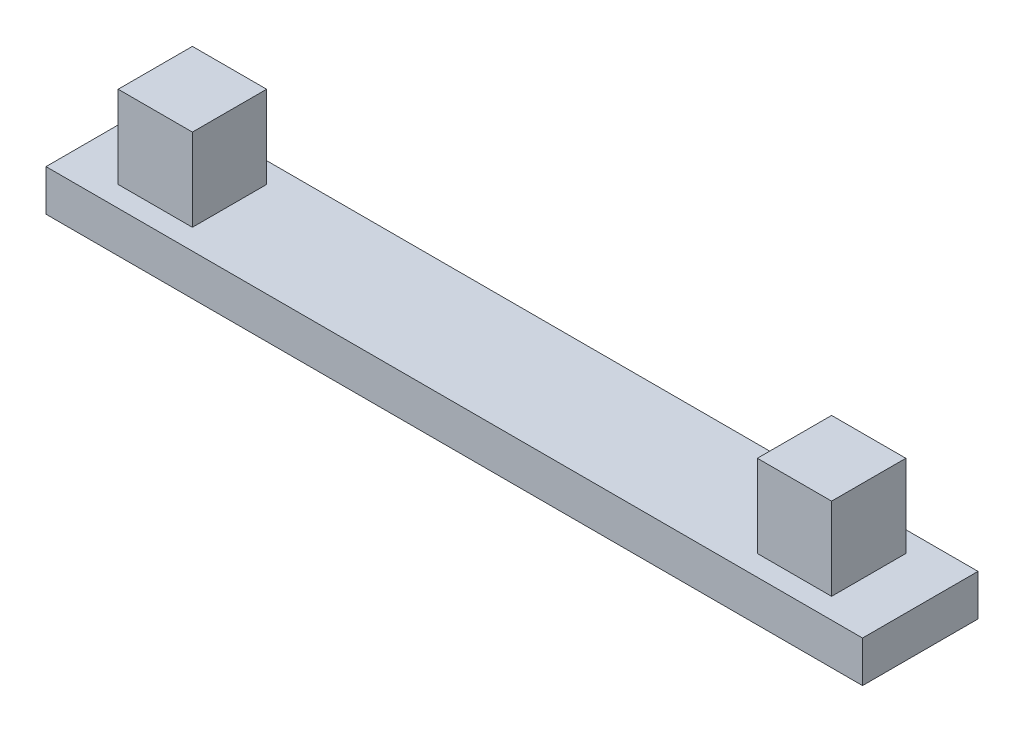
ISO-10303-21;
HEADER;
FILE_DESCRIPTION(('STEP AP214'),'2;1');
FILE_NAME('part.step','',(''),(''),'','','');
FILE_SCHEMA(('AUTOMOTIVE_DESIGN { 1 0 10303 214 1 1 1 1 }'));
ENDSEC;
DATA;
#1=APPLICATION_CONTEXT('core data for automotive mechanical design processes');
#2=APPLICATION_PROTOCOL_DEFINITION('international standard','automotive_design',2000,#1);
#3=PRODUCT_CONTEXT('',#1,'mechanical');
#4=PRODUCT('Part','Part','',(#3));
#5=PRODUCT_RELATED_PRODUCT_CATEGORY('part','',(#4));
#6=PRODUCT_DEFINITION_FORMATION('','',#4);
#7=PRODUCT_DEFINITION_CONTEXT('part definition',#1,'design');
#8=PRODUCT_DEFINITION('design','',#6,#7);
#9=PRODUCT_DEFINITION_SHAPE('','',#8);
#10=(LENGTH_UNIT() NAMED_UNIT(*) SI_UNIT(.MILLI.,.METRE.));
#11=(NAMED_UNIT(*) PLANE_ANGLE_UNIT() SI_UNIT($,.RADIAN.));
#12=(NAMED_UNIT(*) SI_UNIT($,.STERADIAN.) SOLID_ANGLE_UNIT());
#13=UNCERTAINTY_MEASURE_WITH_UNIT(LENGTH_MEASURE(1.E-05),#10,'distance_accuracy_value','');
#14=(GEOMETRIC_REPRESENTATION_CONTEXT(3) GLOBAL_UNCERTAINTY_ASSIGNED_CONTEXT((#13)) GLOBAL_UNIT_ASSIGNED_CONTEXT((#10,
#11,#12)) REPRESENTATION_CONTEXT('',''));
#15=CARTESIAN_POINT('',(0.,0.,0.));
#16=DIRECTION('',(0.,0.,1.));
#17=DIRECTION('',(1.,0.,0.));
#18=AXIS2_PLACEMENT_3D('',#15,#16,#17);
#19=CARTESIAN_POINT('',(0.,1.,0.));
#20=DIRECTION('',(0.,0.,-1.));
#21=DIRECTION('',(-1.,0.,0.));
#22=AXIS2_PLACEMENT_3D('',#19,#20,#21);
#23=PLANE('',#22);
#24=DIRECTION('',(1.,0.,0.));
#25=VECTOR('',#24,1.);
#26=CARTESIAN_POINT('',(0.,0.,0.));
#27=LINE('',#26,#25);
#28=CARTESIAN_POINT('',(0.,0.,0.));
#29=VERTEX_POINT('',#28);
#30=CARTESIAN_POINT('',(19.8,0.,0.));
#31=VERTEX_POINT('',#30);
#32=EDGE_CURVE('E136',#29,#31,#27,.T.);
#33=ORIENTED_EDGE('',*,*,#32,.T.);
#34=DIRECTION('',(0.,-1.,0.));
#35=VECTOR('',#34,1.);
#36=CARTESIAN_POINT('',(19.8,1.,0.));
#37=LINE('',#36,#35);
#38=CARTESIAN_POINT('',(19.8,1.,0.));
#39=VERTEX_POINT('',#38);
#40=EDGE_CURVE('E11',#39,#31,#37,.T.);
#41=ORIENTED_EDGE('',*,*,#40,.F.);
#42=DIRECTION('',(1.,0.,0.));
#43=VECTOR('',#42,1.);
#44=CARTESIAN_POINT('',(0.,1.,0.));
#45=LINE('',#44,#43);
#46=CARTESIAN_POINT('',(0.,1.,0.));
#47=VERTEX_POINT('',#46);
#48=EDGE_CURVE('E101',#47,#39,#45,.T.);
#49=ORIENTED_EDGE('',*,*,#48,.F.);
#50=DIRECTION('',(0.,-1.,0.));
#51=VECTOR('',#50,1.);
#52=CARTESIAN_POINT('',(0.,1.,0.));
#53=LINE('',#52,#51);
#54=EDGE_CURVE('E78',#47,#29,#53,.T.);
#55=ORIENTED_EDGE('',*,*,#54,.T.);
#56=EDGE_LOOP('',(#33,#41,#49,#55));
#57=FACE_BOUND('',#56,.T.);
#58=ADVANCED_FACE('F35',(#57),#23,.F.);
#59=CARTESIAN_POINT('',(19.8,1.,0.));
#60=DIRECTION('',(-1.,0.,0.));
#61=DIRECTION('',(0.,0.,1.));
#62=AXIS2_PLACEMENT_3D('',#59,#60,#61);
#63=PLANE('',#62);
#64=DIRECTION('',(0.,0.,-1.));
#65=VECTOR('',#64,1.);
#66=CARTESIAN_POINT('',(19.8,0.,0.));
#67=LINE('',#66,#65);
#68=CARTESIAN_POINT('',(19.8,0.,-2.8));
#69=VERTEX_POINT('',#68);
#70=EDGE_CURVE('E138',#31,#69,#67,.T.);
#71=ORIENTED_EDGE('',*,*,#70,.T.);
#72=DIRECTION('',(0.,-1.,0.));
#73=VECTOR('',#72,1.);
#74=CARTESIAN_POINT('',(19.8,1.,-2.8));
#75=LINE('',#74,#73);
#76=CARTESIAN_POINT('',(19.8,1.,-2.8));
#77=VERTEX_POINT('',#76);
#78=EDGE_CURVE('E43',#77,#69,#75,.T.);
#79=ORIENTED_EDGE('',*,*,#78,.F.);
#80=DIRECTION('',(0.,0.,-1.));
#81=VECTOR('',#80,1.);
#82=CARTESIAN_POINT('',(19.8,1.,0.));
#83=LINE('',#82,#81);
#84=EDGE_CURVE('E86',#39,#77,#83,.T.);
#85=ORIENTED_EDGE('',*,*,#84,.F.);
#86=ORIENTED_EDGE('',*,*,#40,.T.);
#87=EDGE_LOOP('',(#71,#79,#85,#86));
#88=FACE_BOUND('',#87,.T.);
#89=ADVANCED_FACE('F148',(#88),#63,.F.);
#90=CARTESIAN_POINT('',(0.,1.,-2.8));
#91=DIRECTION('',(0.,0.,-1.));
#92=DIRECTION('',(-1.,0.,0.));
#93=AXIS2_PLACEMENT_3D('',#90,#91,#92);
#94=PLANE('',#93);
#95=DIRECTION('',(1.,0.,0.));
#96=VECTOR('',#95,1.);
#97=CARTESIAN_POINT('',(0.,0.,-2.8));
#98=LINE('',#97,#96);
#99=CARTESIAN_POINT('',(0.,0.,-2.8));
#100=VERTEX_POINT('',#99);
#101=EDGE_CURVE('E142',#100,#69,#98,.T.);
#102=ORIENTED_EDGE('',*,*,#101,.F.);
#103=DIRECTION('',(0.,-1.,0.));
#104=VECTOR('',#103,1.);
#105=CARTESIAN_POINT('',(0.,1.,-2.8));
#106=LINE('',#105,#104);
#107=CARTESIAN_POINT('',(0.,1.,-2.8));
#108=VERTEX_POINT('',#107);
#109=EDGE_CURVE('E70',#108,#100,#106,.T.);
#110=ORIENTED_EDGE('',*,*,#109,.F.);
#111=DIRECTION('',(1.,0.,0.));
#112=VECTOR('',#111,1.);
#113=CARTESIAN_POINT('',(0.,1.,-2.8));
#114=LINE('',#113,#112);
#115=EDGE_CURVE('E108',#108,#77,#114,.T.);
#116=ORIENTED_EDGE('',*,*,#115,.T.);
#117=ORIENTED_EDGE('',*,*,#78,.T.);
#118=EDGE_LOOP('',(#102,#110,#116,#117));
#119=FACE_BOUND('',#118,.T.);
#120=ADVANCED_FACE('F147',(#119),#94,.T.);
#121=CARTESIAN_POINT('',(0.,1.,0.));
#122=DIRECTION('',(-1.,0.,0.));
#123=DIRECTION('',(0.,0.,1.));
#124=AXIS2_PLACEMENT_3D('',#121,#122,#123);
#125=PLANE('',#124);
#126=DIRECTION('',(0.,0.,-1.));
#127=VECTOR('',#126,1.);
#128=CARTESIAN_POINT('',(0.,0.,0.));
#129=LINE('',#128,#127);
#130=EDGE_CURVE('E97',#29,#100,#129,.T.);
#131=ORIENTED_EDGE('',*,*,#130,.F.);
#132=ORIENTED_EDGE('',*,*,#54,.F.);
#133=DIRECTION('',(0.,0.,-1.));
#134=VECTOR('',#133,1.);
#135=CARTESIAN_POINT('',(0.,1.,0.));
#136=LINE('',#135,#134);
#137=EDGE_CURVE('E95',#47,#108,#136,.T.);
#138=ORIENTED_EDGE('',*,*,#137,.T.);
#139=ORIENTED_EDGE('',*,*,#109,.T.);
#140=EDGE_LOOP('',(#131,#132,#138,#139));
#141=FACE_BOUND('',#140,.T.);
#142=ADVANCED_FACE('F93',(#141),#125,.T.);
#143=CARTESIAN_POINT('',(0.,1.,0.));
#144=DIRECTION('',(0.,1.,0.));
#145=DIRECTION('',(0.,0.,1.));
#146=AXIS2_PLACEMENT_3D('',#143,#144,#145);
#147=PLANE('',#146);
#148=ORIENTED_EDGE('',*,*,#48,.T.);
#149=ORIENTED_EDGE('',*,*,#84,.T.);
#150=ORIENTED_EDGE('',*,*,#115,.F.);
#151=ORIENTED_EDGE('',*,*,#137,.F.);
#152=EDGE_LOOP('',(#148,#149,#150,#151));
#153=FACE_BOUND('',#152,.T.);
#154=DIRECTION('',(1.,0.,0.));
#155=VECTOR('',#154,1.);
#156=CARTESIAN_POINT('',(0.,1.,-2.3));
#157=LINE('',#156,#155);
#158=CARTESIAN_POINT('',(1.25,1.,-2.3));
#159=VERTEX_POINT('',#158);
#160=CARTESIAN_POINT('',(3.05,1.,-2.3));
#161=VERTEX_POINT('',#160);
#162=EDGE_CURVE('E109',#159,#161,#157,.T.);
#163=ORIENTED_EDGE('',*,*,#162,.T.);
#164=DIRECTION('',(0.,0.,1.));
#165=VECTOR('',#164,1.);
#166=CARTESIAN_POINT('',(3.05,1.,0.));
#167=LINE('',#166,#165);
#168=CARTESIAN_POINT('',(3.05,1.,-0.5));
#169=VERTEX_POINT('',#168);
#170=EDGE_CURVE('E112',#161,#169,#167,.T.);
#171=ORIENTED_EDGE('',*,*,#170,.T.);
#172=DIRECTION('',(1.,0.,0.));
#173=VECTOR('',#172,1.);
#174=CARTESIAN_POINT('',(0.,1.,-0.5));
#175=LINE('',#174,#173);
#176=CARTESIAN_POINT('',(1.25,1.,-0.5));
#177=VERTEX_POINT('',#176);
#178=EDGE_CURVE('E119',#177,#169,#175,.T.);
#179=ORIENTED_EDGE('',*,*,#178,.F.);
#180=DIRECTION('',(0.,0.,1.));
#181=VECTOR('',#180,1.);
#182=CARTESIAN_POINT('',(1.25,1.,0.));
#183=LINE('',#182,#181);
#184=EDGE_CURVE('E122',#159,#177,#183,.T.);
#185=ORIENTED_EDGE('',*,*,#184,.F.);
#186=EDGE_LOOP('',(#163,#171,#179,#185));
#187=FACE_BOUND('',#186,.T.);
#188=DIRECTION('',(1.,0.,0.));
#189=VECTOR('',#188,1.);
#190=CARTESIAN_POINT('',(0.,1.,-2.3));
#191=LINE('',#190,#189);
#192=CARTESIAN_POINT('',(16.75,1.,-2.3));
#193=VERTEX_POINT('',#192);
#194=CARTESIAN_POINT('',(18.55,1.,-2.3));
#195=VERTEX_POINT('',#194);
#196=EDGE_CURVE('E125',#193,#195,#191,.T.);
#197=ORIENTED_EDGE('',*,*,#196,.T.);
#198=DIRECTION('',(0.,0.,1.));
#199=VECTOR('',#198,1.);
#200=CARTESIAN_POINT('',(18.55,1.,0.));
#201=LINE('',#200,#199);
#202=CARTESIAN_POINT('',(18.55,1.,-0.499999999999999));
#203=VERTEX_POINT('',#202);
#204=EDGE_CURVE('E128',#195,#203,#201,.T.);
#205=ORIENTED_EDGE('',*,*,#204,.T.);
#206=DIRECTION('',(1.,0.,0.));
#207=VECTOR('',#206,1.);
#208=CARTESIAN_POINT('',(0.,1.,-0.499999999999999));
#209=LINE('',#208,#207);
#210=CARTESIAN_POINT('',(16.75,1.,-0.499999999999999));
#211=VERTEX_POINT('',#210);
#212=EDGE_CURVE('E131',#211,#203,#209,.T.);
#213=ORIENTED_EDGE('',*,*,#212,.F.);
#214=DIRECTION('',(0.,0.,1.));
#215=VECTOR('',#214,1.);
#216=CARTESIAN_POINT('',(16.75,1.,0.));
#217=LINE('',#216,#215);
#218=EDGE_CURVE('E98',#193,#211,#217,.T.);
#219=ORIENTED_EDGE('',*,*,#218,.F.);
#220=EDGE_LOOP('',(#197,#205,#213,#219));
#221=FACE_BOUND('',#220,.T.);
#222=ADVANCED_FACE('F105',(#153,#187,#221),#147,.T.);
#223=CARTESIAN_POINT('',(0.,0.,0.));
#224=DIRECTION('',(0.,1.,0.));
#225=DIRECTION('',(0.,0.,1.));
#226=AXIS2_PLACEMENT_3D('',#223,#224,#225);
#227=PLANE('',#226);
#228=ORIENTED_EDGE('',*,*,#32,.F.);
#229=ORIENTED_EDGE('',*,*,#130,.T.);
#230=ORIENTED_EDGE('',*,*,#101,.T.);
#231=ORIENTED_EDGE('',*,*,#70,.F.);
#232=EDGE_LOOP('',(#228,#229,#230,#231));
#233=FACE_BOUND('',#232,.T.);
#234=ADVANCED_FACE('F150',(#233),#227,.F.);
#235=CARTESIAN_POINT('',(1.25,3.,-2.3));
#236=DIRECTION('',(1.,0.,0.));
#237=DIRECTION('',(0.,0.,-1.));
#238=AXIS2_PLACEMENT_3D('',#235,#236,#237);
#239=PLANE('',#238);
#240=ORIENTED_EDGE('',*,*,#184,.T.);
#241=DIRECTION('',(0.,-1.,0.));
#242=VECTOR('',#241,1.);
#243=CARTESIAN_POINT('',(1.25,3.,-0.5));
#244=LINE('',#243,#242);
#245=CARTESIAN_POINT('',(1.25,3.,-0.5));
#246=VERTEX_POINT('',#245);
#247=EDGE_CURVE('E139',#246,#177,#244,.T.);
#248=ORIENTED_EDGE('',*,*,#247,.F.);
#249=DIRECTION('',(0.,0.,1.));
#250=VECTOR('',#249,1.);
#251=CARTESIAN_POINT('',(1.25,3.,-2.3));
#252=LINE('',#251,#250);
#253=CARTESIAN_POINT('',(1.25,3.,-2.3));
#254=VERTEX_POINT('',#253);
#255=EDGE_CURVE('E301',#254,#246,#252,.T.);
#256=ORIENTED_EDGE('',*,*,#255,.F.);
#257=DIRECTION('',(0.,-1.,0.));
#258=VECTOR('',#257,1.);
#259=CARTESIAN_POINT('',(1.25,3.,-2.3));
#260=LINE('',#259,#258);
#261=EDGE_CURVE('E332',#254,#159,#260,.T.);
#262=ORIENTED_EDGE('',*,*,#261,.T.);
#263=EDGE_LOOP('',(#240,#248,#256,#262));
#264=FACE_BOUND('',#263,.T.);
#265=ADVANCED_FACE('F152',(#264),#239,.F.);
#266=CARTESIAN_POINT('',(1.25,3.,-0.5));
#267=DIRECTION('',(0.,0.,-1.));
#268=DIRECTION('',(-1.,0.,0.));
#269=AXIS2_PLACEMENT_3D('',#266,#267,#268);
#270=PLANE('',#269);
#271=ORIENTED_EDGE('',*,*,#178,.T.);
#272=DIRECTION('',(0.,-1.,0.));
#273=VECTOR('',#272,1.);
#274=CARTESIAN_POINT('',(3.05,3.,-0.5));
#275=LINE('',#274,#273);
#276=CARTESIAN_POINT('',(3.05,3.,-0.5));
#277=VERTEX_POINT('',#276);
#278=EDGE_CURVE('E337',#277,#169,#275,.T.);
#279=ORIENTED_EDGE('',*,*,#278,.F.);
#280=DIRECTION('',(1.,0.,0.));
#281=VECTOR('',#280,1.);
#282=CARTESIAN_POINT('',(1.25,3.,-0.5));
#283=LINE('',#282,#281);
#284=EDGE_CURVE('E323',#246,#277,#283,.T.);
#285=ORIENTED_EDGE('',*,*,#284,.F.);
#286=ORIENTED_EDGE('',*,*,#247,.T.);
#287=EDGE_LOOP('',(#271,#279,#285,#286));
#288=FACE_BOUND('',#287,.T.);
#289=ADVANCED_FACE('F158',(#288),#270,.F.);
#290=CARTESIAN_POINT('',(3.05,3.,-2.3));
#291=DIRECTION('',(1.,0.,0.));
#292=DIRECTION('',(0.,0.,-1.));
#293=AXIS2_PLACEMENT_3D('',#290,#291,#292);
#294=PLANE('',#293);
#295=ORIENTED_EDGE('',*,*,#278,.T.);
#296=ORIENTED_EDGE('',*,*,#170,.F.);
#297=DIRECTION('',(0.,-1.,0.));
#298=VECTOR('',#297,1.);
#299=CARTESIAN_POINT('',(3.05,3.,-2.3));
#300=LINE('',#299,#298);
#301=CARTESIAN_POINT('',(3.05,3.,-2.3));
#302=VERTEX_POINT('',#301);
#303=EDGE_CURVE('E335',#302,#161,#300,.T.);
#304=ORIENTED_EDGE('',*,*,#303,.F.);
#305=DIRECTION('',(0.,0.,1.));
#306=VECTOR('',#305,1.);
#307=CARTESIAN_POINT('',(3.05,3.,-2.3));
#308=LINE('',#307,#306);
#309=EDGE_CURVE('E326',#302,#277,#308,.T.);
#310=ORIENTED_EDGE('',*,*,#309,.T.);
#311=EDGE_LOOP('',(#295,#296,#304,#310));
#312=FACE_BOUND('',#311,.T.);
#313=ADVANCED_FACE('F201',(#312),#294,.T.);
#314=CARTESIAN_POINT('',(1.25,3.,-2.3));
#315=DIRECTION('',(0.,0.,-1.));
#316=DIRECTION('',(-1.,0.,0.));
#317=AXIS2_PLACEMENT_3D('',#314,#315,#316);
#318=PLANE('',#317);
#319=ORIENTED_EDGE('',*,*,#303,.T.);
#320=ORIENTED_EDGE('',*,*,#162,.F.);
#321=ORIENTED_EDGE('',*,*,#261,.F.);
#322=DIRECTION('',(1.,0.,0.));
#323=VECTOR('',#322,1.);
#324=CARTESIAN_POINT('',(1.25,3.,-2.3));
#325=LINE('',#324,#323);
#326=EDGE_CURVE('E329',#254,#302,#325,.T.);
#327=ORIENTED_EDGE('',*,*,#326,.T.);
#328=EDGE_LOOP('',(#319,#320,#321,#327));
#329=FACE_BOUND('',#328,.T.);
#330=ADVANCED_FACE('F211',(#329),#318,.T.);
#331=CARTESIAN_POINT('',(0.,3.,0.));
#332=DIRECTION('',(0.,1.,0.));
#333=DIRECTION('',(0.,0.,1.));
#334=AXIS2_PLACEMENT_3D('',#331,#332,#333);
#335=PLANE('',#334);
#336=ORIENTED_EDGE('',*,*,#255,.T.);
#337=ORIENTED_EDGE('',*,*,#284,.T.);
#338=ORIENTED_EDGE('',*,*,#309,.F.);
#339=ORIENTED_EDGE('',*,*,#326,.F.);
#340=EDGE_LOOP('',(#336,#337,#338,#339));
#341=FACE_BOUND('',#340,.T.);
#342=ADVANCED_FACE('F221',(#341),#335,.T.);
#343=CARTESIAN_POINT('',(16.75,3.,-2.3));
#344=DIRECTION('',(1.,0.,0.));
#345=DIRECTION('',(0.,0.,-1.));
#346=AXIS2_PLACEMENT_3D('',#343,#344,#345);
#347=PLANE('',#346);
#348=ORIENTED_EDGE('',*,*,#218,.T.);
#349=DIRECTION('',(0.,-1.,0.));
#350=VECTOR('',#349,1.);
#351=CARTESIAN_POINT('',(16.75,3.,-0.499999999999999));
#352=LINE('',#351,#350);
#353=CARTESIAN_POINT('',(16.75,3.,-0.499999999999999));
#354=VERTEX_POINT('',#353);
#355=EDGE_CURVE('E304',#354,#211,#352,.T.);
#356=ORIENTED_EDGE('',*,*,#355,.F.);
#357=DIRECTION('',(0.,0.,1.));
#358=VECTOR('',#357,1.);
#359=CARTESIAN_POINT('',(16.75,3.,-2.3));
#360=LINE('',#359,#358);
#361=CARTESIAN_POINT('',(16.75,3.,-2.3));
#362=VERTEX_POINT('',#361);
#363=EDGE_CURVE('E289',#362,#354,#360,.T.);
#364=ORIENTED_EDGE('',*,*,#363,.F.);
#365=DIRECTION('',(0.,-1.,0.));
#366=VECTOR('',#365,1.);
#367=CARTESIAN_POINT('',(16.75,3.,-2.3));
#368=LINE('',#367,#366);
#369=EDGE_CURVE('E314',#362,#193,#368,.T.);
#370=ORIENTED_EDGE('',*,*,#369,.T.);
#371=EDGE_LOOP('',(#348,#356,#364,#370));
#372=FACE_BOUND('',#371,.T.);
#373=ADVANCED_FACE('F231',(#372),#347,.F.);
#374=CARTESIAN_POINT('',(16.75,3.,-0.499999999999999));
#375=DIRECTION('',(0.,0.,-1.));
#376=DIRECTION('',(-1.,0.,0.));
#377=AXIS2_PLACEMENT_3D('',#374,#375,#376);
#378=PLANE('',#377);
#379=ORIENTED_EDGE('',*,*,#212,.T.);
#380=DIRECTION('',(0.,-1.,0.));
#381=VECTOR('',#380,1.);
#382=CARTESIAN_POINT('',(18.55,3.,-0.499999999999999));
#383=LINE('',#382,#381);
#384=CARTESIAN_POINT('',(18.55,3.,-0.499999999999999));
#385=VERTEX_POINT('',#384);
#386=EDGE_CURVE('E308',#385,#203,#383,.T.);
#387=ORIENTED_EDGE('',*,*,#386,.F.);
#388=DIRECTION('',(1.,0.,0.));
#389=VECTOR('',#388,1.);
#390=CARTESIAN_POINT('',(16.75,3.,-0.499999999999999));
#391=LINE('',#390,#389);
#392=EDGE_CURVE('E294',#354,#385,#391,.T.);
#393=ORIENTED_EDGE('',*,*,#392,.F.);
#394=ORIENTED_EDGE('',*,*,#355,.T.);
#395=EDGE_LOOP('',(#379,#387,#393,#394));
#396=FACE_BOUND('',#395,.T.);
#397=ADVANCED_FACE('F241',(#396),#378,.F.);
#398=CARTESIAN_POINT('',(18.55,3.,-2.3));
#399=DIRECTION('',(1.,0.,0.));
#400=DIRECTION('',(0.,0.,-1.));
#401=AXIS2_PLACEMENT_3D('',#398,#399,#400);
#402=PLANE('',#401);
#403=ORIENTED_EDGE('',*,*,#386,.T.);
#404=ORIENTED_EDGE('',*,*,#204,.F.);
#405=DIRECTION('',(0.,-1.,0.));
#406=VECTOR('',#405,1.);
#407=CARTESIAN_POINT('',(18.55,3.,-2.3));
#408=LINE('',#407,#406);
#409=CARTESIAN_POINT('',(18.55,3.,-2.3));
#410=VERTEX_POINT('',#409);
#411=EDGE_CURVE('E51',#410,#195,#408,.T.);
#412=ORIENTED_EDGE('',*,*,#411,.F.);
#413=DIRECTION('',(0.,0.,1.));
#414=VECTOR('',#413,1.);
#415=CARTESIAN_POINT('',(18.55,3.,-2.3));
#416=LINE('',#415,#414);
#417=EDGE_CURVE('E317',#410,#385,#416,.T.);
#418=ORIENTED_EDGE('',*,*,#417,.T.);
#419=EDGE_LOOP('',(#403,#404,#412,#418));
#420=FACE_BOUND('',#419,.T.);
#421=ADVANCED_FACE('F251',(#420),#402,.T.);
#422=CARTESIAN_POINT('',(16.75,3.,-2.3));
#423=DIRECTION('',(0.,0.,-1.));
#424=DIRECTION('',(-1.,0.,0.));
#425=AXIS2_PLACEMENT_3D('',#422,#423,#424);
#426=PLANE('',#425);
#427=ORIENTED_EDGE('',*,*,#411,.T.);
#428=ORIENTED_EDGE('',*,*,#196,.F.);
#429=ORIENTED_EDGE('',*,*,#369,.F.);
#430=DIRECTION('',(1.,0.,0.));
#431=VECTOR('',#430,1.);
#432=CARTESIAN_POINT('',(16.75,3.,-2.3));
#433=LINE('',#432,#431);
#434=EDGE_CURVE('E297',#362,#410,#433,.T.);
#435=ORIENTED_EDGE('',*,*,#434,.T.);
#436=EDGE_LOOP('',(#427,#428,#429,#435));
#437=FACE_BOUND('',#436,.T.);
#438=ADVANCED_FACE('F261',(#437),#426,.T.);
#439=CARTESIAN_POINT('',(0.,3.,0.));
#440=DIRECTION('',(0.,1.,0.));
#441=DIRECTION('',(0.,0.,1.));
#442=AXIS2_PLACEMENT_3D('',#439,#440,#441);
#443=PLANE('',#442);
#444=ORIENTED_EDGE('',*,*,#363,.T.);
#445=ORIENTED_EDGE('',*,*,#392,.T.);
#446=ORIENTED_EDGE('',*,*,#417,.F.);
#447=ORIENTED_EDGE('',*,*,#434,.F.);
#448=EDGE_LOOP('',(#444,#445,#446,#447));
#449=FACE_BOUND('',#448,.T.);
#450=ADVANCED_FACE('F271',(#449),#443,.T.);
#451=CLOSED_SHELL('',(#58,#89,#120,#142,#222,#234,#265,#289,#313,#330,#342,#373,#397,#421,#438,#450));
#452=MANIFOLD_SOLID_BREP('B2',#451);
#453=ADVANCED_BREP_SHAPE_REPRESENTATION('',(#18,#452),#14);
#454=SHAPE_DEFINITION_REPRESENTATION(#9,#453);
ENDSEC;
END-ISO-10303-21;
